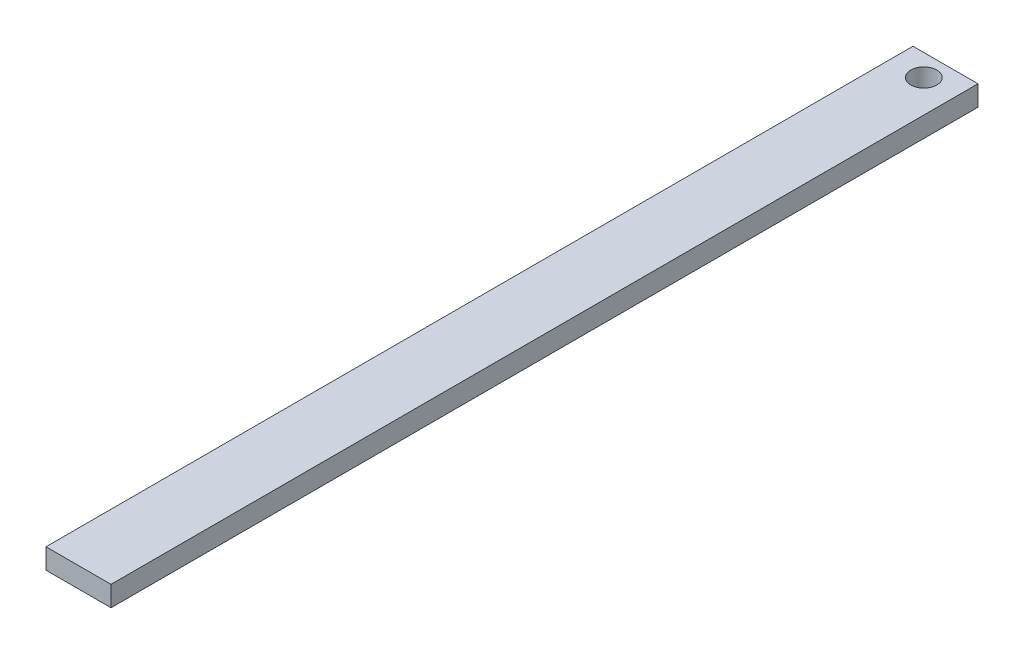
ISO-10303-21;
HEADER;
FILE_DESCRIPTION(('STEP AP214'),'2;1');
FILE_NAME('part.step','',(''),(''),'','','');
FILE_SCHEMA(('AUTOMOTIVE_DESIGN { 1 0 10303 214 1 1 1 1 }'));
ENDSEC;
DATA;
#1=APPLICATION_CONTEXT('core data for automotive mechanical design processes');
#2=APPLICATION_PROTOCOL_DEFINITION('international standard','automotive_design',2000,#1);
#3=PRODUCT_CONTEXT('',#1,'mechanical');
#4=PRODUCT('Part','Part','',(#3));
#5=PRODUCT_RELATED_PRODUCT_CATEGORY('part','',(#4));
#6=PRODUCT_DEFINITION_FORMATION('','',#4);
#7=PRODUCT_DEFINITION_CONTEXT('part definition',#1,'design');
#8=PRODUCT_DEFINITION('design','',#6,#7);
#9=PRODUCT_DEFINITION_SHAPE('','',#8);
#10=(LENGTH_UNIT() NAMED_UNIT(*) SI_UNIT(.MILLI.,.METRE.));
#11=(NAMED_UNIT(*) PLANE_ANGLE_UNIT() SI_UNIT($,.RADIAN.));
#12=(NAMED_UNIT(*) SI_UNIT($,.STERADIAN.) SOLID_ANGLE_UNIT());
#13=UNCERTAINTY_MEASURE_WITH_UNIT(LENGTH_MEASURE(1.E-05),#10,'distance_accuracy_value','');
#14=(GEOMETRIC_REPRESENTATION_CONTEXT(3) GLOBAL_UNCERTAINTY_ASSIGNED_CONTEXT((#13)) GLOBAL_UNIT_ASSIGNED_CONTEXT((#10,
#11,#12)) REPRESENTATION_CONTEXT('',''));
#15=CARTESIAN_POINT('',(0.,0.,0.));
#16=DIRECTION('',(0.,0.,1.));
#17=DIRECTION('',(1.,0.,0.));
#18=AXIS2_PLACEMENT_3D('',#15,#16,#17);
#19=CARTESIAN_POINT('',(7.62,0.,101.6));
#20=DIRECTION('',(0.,1.,0.));
#21=DIRECTION('',(-1.,0.,0.));
#22=AXIS2_PLACEMENT_3D('',#19,#20,#21);
#23=PLANE('',#22);
#24=CARTESIAN_POINT('',(3.81,0.,2.54));
#25=DIRECTION('',(0.,1.,0.));
#26=DIRECTION('',(-1.,0.,0.));
#27=AXIS2_PLACEMENT_3D('',#24,#25,#26);
#28=CIRCLE('',#27,1.524);
#29=CARTESIAN_POINT('',(2.286,0.,2.54));
#30=VERTEX_POINT('',#29);
#31=EDGE_CURVE('E117',#30,#30,#28,.T.);
#32=ORIENTED_EDGE('',*,*,#31,.T.);
#33=EDGE_LOOP('',(#32));
#34=FACE_BOUND('',#33,.T.);
#35=DIRECTION('',(1.,0.,0.));
#36=VECTOR('',#35,1.);
#37=CARTESIAN_POINT('',(7.62,0.,0.));
#38=LINE('',#37,#36);
#39=CARTESIAN_POINT('',(0.,0.,0.));
#40=VERTEX_POINT('',#39);
#41=CARTESIAN_POINT('',(7.62,0.,0.));
#42=VERTEX_POINT('',#41);
#43=EDGE_CURVE('E113',#40,#42,#38,.T.);
#44=ORIENTED_EDGE('',*,*,#43,.T.);
#45=DIRECTION('',(0.,0.,-1.));
#46=VECTOR('',#45,1.);
#47=CARTESIAN_POINT('',(7.62,0.,101.6));
#48=LINE('',#47,#46);
#49=CARTESIAN_POINT('',(7.62,0.,101.6));
#50=VERTEX_POINT('',#49);
#51=EDGE_CURVE('E11',#50,#42,#48,.T.);
#52=ORIENTED_EDGE('',*,*,#51,.F.);
#53=DIRECTION('',(1.,0.,0.));
#54=VECTOR('',#53,1.);
#55=CARTESIAN_POINT('',(7.62,0.,101.6));
#56=LINE('',#55,#54);
#57=CARTESIAN_POINT('',(0.,0.,101.6));
#58=VERTEX_POINT('',#57);
#59=EDGE_CURVE('E97',#58,#50,#56,.T.);
#60=ORIENTED_EDGE('',*,*,#59,.F.);
#61=DIRECTION('',(0.,0.,-1.));
#62=VECTOR('',#61,1.);
#63=CARTESIAN_POINT('',(0.,0.,101.6));
#64=LINE('',#63,#62);
#65=EDGE_CURVE('E109',#58,#40,#64,.T.);
#66=ORIENTED_EDGE('',*,*,#65,.T.);
#67=EDGE_LOOP('',(#44,#52,#60,#66));
#68=FACE_BOUND('',#67,.T.);
#69=ADVANCED_FACE('F45',(#34,#68),#23,.F.);
#70=CARTESIAN_POINT('',(7.62,2.38125,101.6));
#71=DIRECTION('',(-1.,0.,0.));
#72=DIRECTION('',(0.,-1.,0.));
#73=AXIS2_PLACEMENT_3D('',#70,#71,#72);
#74=PLANE('',#73);
#75=DIRECTION('',(0.,1.,0.));
#76=VECTOR('',#75,1.);
#77=CARTESIAN_POINT('',(7.62,2.38125,0.));
#78=LINE('',#77,#76);
#79=CARTESIAN_POINT('',(7.62,2.38125,0.));
#80=VERTEX_POINT('',#79);
#81=EDGE_CURVE('E102',#42,#80,#78,.T.);
#82=ORIENTED_EDGE('',*,*,#81,.T.);
#83=DIRECTION('',(0.,0.,-1.));
#84=VECTOR('',#83,1.);
#85=CARTESIAN_POINT('',(7.62,2.38125,101.6));
#86=LINE('',#85,#84);
#87=CARTESIAN_POINT('',(7.62,2.38125,101.6));
#88=VERTEX_POINT('',#87);
#89=EDGE_CURVE('E54',#88,#80,#86,.T.);
#90=ORIENTED_EDGE('',*,*,#89,.F.);
#91=DIRECTION('',(0.,1.,0.));
#92=VECTOR('',#91,1.);
#93=CARTESIAN_POINT('',(7.62,2.38125,101.6));
#94=LINE('',#93,#92);
#95=EDGE_CURVE('E92',#50,#88,#94,.T.);
#96=ORIENTED_EDGE('',*,*,#95,.F.);
#97=ORIENTED_EDGE('',*,*,#51,.T.);
#98=EDGE_LOOP('',(#82,#90,#96,#97));
#99=FACE_BOUND('',#98,.T.);
#100=ADVANCED_FACE('F101',(#99),#74,.F.);
#101=CARTESIAN_POINT('',(0.,2.38125,101.6));
#102=DIRECTION('',(0.,-1.,0.));
#103=DIRECTION('',(1.,0.,0.));
#104=AXIS2_PLACEMENT_3D('',#101,#102,#103);
#105=PLANE('',#104);
#106=CARTESIAN_POINT('',(3.81,2.38125,2.54));
#107=DIRECTION('',(0.,1.,0.));
#108=DIRECTION('',(-1.,0.,0.));
#109=AXIS2_PLACEMENT_3D('',#106,#107,#108);
#110=CIRCLE('',#109,1.524);
#111=CARTESIAN_POINT('',(2.286,2.38125,2.54));
#112=VERTEX_POINT('',#111);
#113=EDGE_CURVE('E134',#112,#112,#110,.T.);
#114=ORIENTED_EDGE('',*,*,#113,.F.);
#115=EDGE_LOOP('',(#114));
#116=FACE_BOUND('',#115,.T.);
#117=DIRECTION('',(-1.,0.,0.));
#118=VECTOR('',#117,1.);
#119=CARTESIAN_POINT('',(0.,2.38125,0.));
#120=LINE('',#119,#118);
#121=CARTESIAN_POINT('',(0.,2.38125,0.));
#122=VERTEX_POINT('',#121);
#123=EDGE_CURVE('E79',#80,#122,#120,.T.);
#124=ORIENTED_EDGE('',*,*,#123,.T.);
#125=DIRECTION('',(0.,0.,-1.));
#126=VECTOR('',#125,1.);
#127=CARTESIAN_POINT('',(0.,2.38125,101.6));
#128=LINE('',#127,#126);
#129=CARTESIAN_POINT('',(0.,2.38125,101.6));
#130=VERTEX_POINT('',#129);
#131=EDGE_CURVE('E104',#130,#122,#128,.T.);
#132=ORIENTED_EDGE('',*,*,#131,.F.);
#133=DIRECTION('',(-1.,0.,0.));
#134=VECTOR('',#133,1.);
#135=CARTESIAN_POINT('',(0.,2.38125,101.6));
#136=LINE('',#135,#134);
#137=EDGE_CURVE('E95',#88,#130,#136,.T.);
#138=ORIENTED_EDGE('',*,*,#137,.F.);
#139=ORIENTED_EDGE('',*,*,#89,.T.);
#140=EDGE_LOOP('',(#124,#132,#138,#139));
#141=FACE_BOUND('',#140,.T.);
#142=ADVANCED_FACE('F105',(#116,#141),#105,.F.);
#143=CARTESIAN_POINT('',(0.,0.,101.6));
#144=DIRECTION('',(1.,0.,0.));
#145=DIRECTION('',(0.,0.,-1.));
#146=AXIS2_PLACEMENT_3D('',#143,#144,#145);
#147=PLANE('',#146);
#148=DIRECTION('',(0.,-1.,0.));
#149=VECTOR('',#148,1.);
#150=CARTESIAN_POINT('',(0.,0.,0.));
#151=LINE('',#150,#149);
#152=EDGE_CURVE('E85',#122,#40,#151,.T.);
#153=ORIENTED_EDGE('',*,*,#152,.T.);
#154=ORIENTED_EDGE('',*,*,#65,.F.);
#155=DIRECTION('',(0.,-1.,0.));
#156=VECTOR('',#155,1.);
#157=CARTESIAN_POINT('',(0.,0.,101.6));
#158=LINE('',#157,#156);
#159=EDGE_CURVE('E62',#130,#58,#158,.T.);
#160=ORIENTED_EDGE('',*,*,#159,.F.);
#161=ORIENTED_EDGE('',*,*,#131,.T.);
#162=EDGE_LOOP('',(#153,#154,#160,#161));
#163=FACE_BOUND('',#162,.T.);
#164=ADVANCED_FACE('F127',(#163),#147,.F.);
#165=CARTESIAN_POINT('',(0.,0.,101.6));
#166=DIRECTION('',(0.,0.,-1.));
#167=DIRECTION('',(-1.,0.,0.));
#168=AXIS2_PLACEMENT_3D('',#165,#166,#167);
#169=PLANE('',#168);
#170=ORIENTED_EDGE('',*,*,#59,.T.);
#171=ORIENTED_EDGE('',*,*,#95,.T.);
#172=ORIENTED_EDGE('',*,*,#137,.T.);
#173=ORIENTED_EDGE('',*,*,#159,.T.);
#174=EDGE_LOOP('',(#170,#171,#172,#173));
#175=FACE_BOUND('',#174,.T.);
#176=ADVANCED_FACE('F93',(#175),#169,.F.);
#177=CARTESIAN_POINT('',(0.,0.,0.));
#178=DIRECTION('',(0.,0.,-1.));
#179=DIRECTION('',(-1.,0.,0.));
#180=AXIS2_PLACEMENT_3D('',#177,#178,#179);
#181=PLANE('',#180);
#182=ORIENTED_EDGE('',*,*,#43,.F.);
#183=ORIENTED_EDGE('',*,*,#152,.F.);
#184=ORIENTED_EDGE('',*,*,#123,.F.);
#185=ORIENTED_EDGE('',*,*,#81,.F.);
#186=EDGE_LOOP('',(#182,#183,#184,#185));
#187=FACE_BOUND('',#186,.T.);
#188=ADVANCED_FACE('F130',(#187),#181,.T.);
#189=CARTESIAN_POINT('',(3.81,0.,2.54));
#190=DIRECTION('',(0.,1.,0.));
#191=DIRECTION('',(-1.,0.,0.));
#192=AXIS2_PLACEMENT_3D('',#189,#190,#191);
#193=CYLINDRICAL_SURFACE('',#192,1.524);
#194=ORIENTED_EDGE('',*,*,#31,.F.);
#195=EDGE_LOOP('',(#194));
#196=FACE_BOUND('',#195,.T.);
#197=ORIENTED_EDGE('',*,*,#113,.T.);
#198=EDGE_LOOP('',(#197));
#199=FACE_BOUND('',#198,.T.);
#200=ADVANCED_FACE('F143',(#196,#199),#193,.F.);
#201=CLOSED_SHELL('',(#69,#100,#142,#164,#176,#188,#200));
#202=MANIFOLD_SOLID_BREP('B2',#201);
#203=ADVANCED_BREP_SHAPE_REPRESENTATION('',(#18,#202),#14);
#204=SHAPE_DEFINITION_REPRESENTATION(#9,#203);
ENDSEC;
END-ISO-10303-21;
